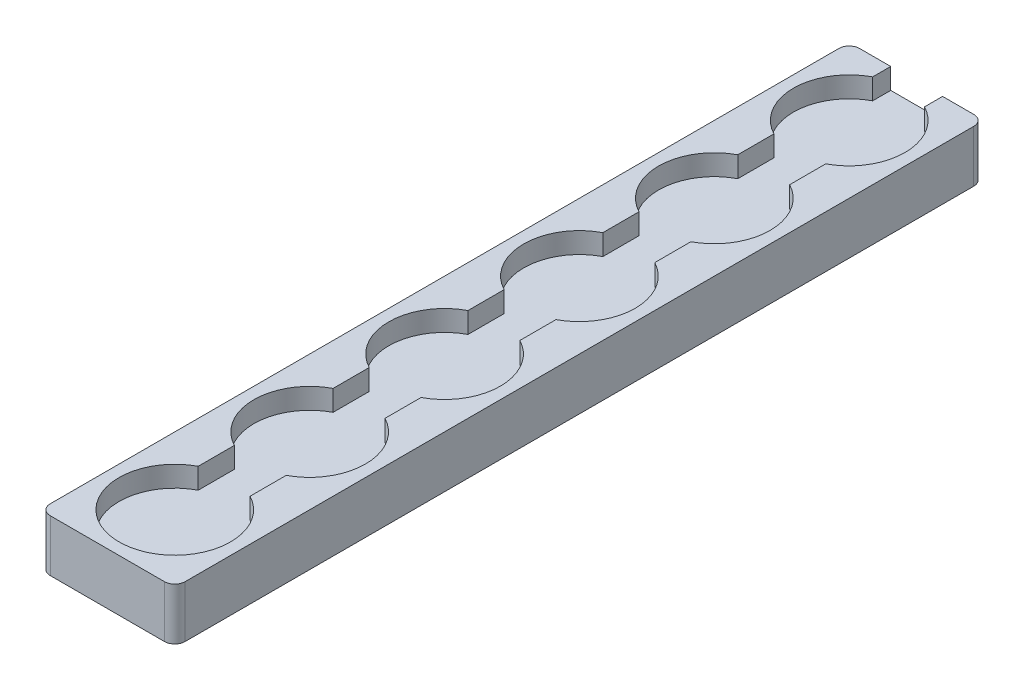
ISO-10303-21;
HEADER;
FILE_DESCRIPTION(('STEP AP214'),'2;1');
FILE_NAME('part.step','',(''),(''),'','','');
FILE_SCHEMA(('AUTOMOTIVE_DESIGN { 1 0 10303 214 1 1 1 1 }'));
ENDSEC;
DATA;
#1=APPLICATION_CONTEXT('core data for automotive mechanical design processes');
#2=APPLICATION_PROTOCOL_DEFINITION('international standard','automotive_design',2000,#1);
#3=PRODUCT_CONTEXT('',#1,'mechanical');
#4=PRODUCT('Part','Part','',(#3));
#5=PRODUCT_RELATED_PRODUCT_CATEGORY('part','',(#4));
#6=PRODUCT_DEFINITION_FORMATION('','',#4);
#7=PRODUCT_DEFINITION_CONTEXT('part definition',#1,'design');
#8=PRODUCT_DEFINITION('design','',#6,#7);
#9=PRODUCT_DEFINITION_SHAPE('','',#8);
#10=(LENGTH_UNIT() NAMED_UNIT(*) SI_UNIT(.MILLI.,.METRE.));
#11=(NAMED_UNIT(*) PLANE_ANGLE_UNIT() SI_UNIT($,.RADIAN.));
#12=(NAMED_UNIT(*) SI_UNIT($,.STERADIAN.) SOLID_ANGLE_UNIT());
#13=UNCERTAINTY_MEASURE_WITH_UNIT(LENGTH_MEASURE(1.E-05),#10,'distance_accuracy_value','');
#14=(GEOMETRIC_REPRESENTATION_CONTEXT(3) GLOBAL_UNCERTAINTY_ASSIGNED_CONTEXT((#13)) GLOBAL_UNIT_ASSIGNED_CONTEXT((#10,
#11,#12)) REPRESENTATION_CONTEXT('',''));
#15=CARTESIAN_POINT('',(0.,0.,0.));
#16=DIRECTION('',(0.,0.,1.));
#17=DIRECTION('',(1.,0.,0.));
#18=AXIS2_PLACEMENT_3D('',#15,#16,#17);
#19=CARTESIAN_POINT('',(0.,-4.,-130.));
#20=DIRECTION('',(0.,1.,0.));
#21=DIRECTION('',(0.,0.,1.));
#22=AXIS2_PLACEMENT_3D('',#19,#20,#21);
#23=CYLINDRICAL_SURFACE('',#22,10.75);
#24=CARTESIAN_POINT('',(0.,0.,-130.));
#25=DIRECTION('',(0.,1.,0.));
#26=DIRECTION('',(0.,0.,1.));
#27=AXIS2_PLACEMENT_3D('',#24,#25,#26);
#28=CIRCLE('',#27,10.75);
#29=CARTESIAN_POINT('',(-5.,0.,-139.516433155337));
#30=VERTEX_POINT('',#29);
#31=CARTESIAN_POINT('',(-5.,0.,-120.483566844663));
#32=VERTEX_POINT('',#31);
#33=EDGE_CURVE('E477',#30,#32,#28,.T.);
#34=ORIENTED_EDGE('',*,*,#33,.T.);
#35=DIRECTION('',(0.,1.,0.));
#36=VECTOR('',#35,1.);
#37=CARTESIAN_POINT('',(-5.,-4.,-120.483566844663));
#38=LINE('',#37,#36);
#39=CARTESIAN_POINT('',(-5.,-4.,-120.483566844663));
#40=VERTEX_POINT('',#39);
#41=EDGE_CURVE('E348',#32,#40,#38,.F.);
#42=ORIENTED_EDGE('',*,*,#41,.T.);
#43=CARTESIAN_POINT('',(0.,-4.,-130.));
#44=DIRECTION('',(0.,1.,0.));
#45=DIRECTION('',(0.,0.,1.));
#46=AXIS2_PLACEMENT_3D('',#43,#44,#45);
#47=CIRCLE('',#46,10.75);
#48=CARTESIAN_POINT('',(-5.,-4.,-139.516433155337));
#49=VERTEX_POINT('',#48);
#50=EDGE_CURVE('E473',#49,#40,#47,.T.);
#51=ORIENTED_EDGE('',*,*,#50,.F.);
#52=DIRECTION('',(0.,1.,0.));
#53=VECTOR('',#52,1.);
#54=CARTESIAN_POINT('',(-5.,-4.,-139.516433155337));
#55=LINE('',#54,#53);
#56=EDGE_CURVE('E432',#49,#30,#55,.T.);
#57=ORIENTED_EDGE('',*,*,#56,.T.);
#58=EDGE_LOOP('',(#34,#42,#51,#57));
#59=FACE_BOUND('',#58,.T.);
#60=ADVANCED_FACE('F48',(#59),#23,.F.);
#61=CARTESIAN_POINT('',(0.,-4.,-104.));
#62=DIRECTION('',(0.,1.,0.));
#63=DIRECTION('',(0.,0.,1.));
#64=AXIS2_PLACEMENT_3D('',#61,#62,#63);
#65=CYLINDRICAL_SURFACE('',#64,10.75);
#66=CARTESIAN_POINT('',(0.,0.,-104.));
#67=DIRECTION('',(0.,1.,0.));
#68=DIRECTION('',(0.,0.,1.));
#69=AXIS2_PLACEMENT_3D('',#66,#67,#68);
#70=CIRCLE('',#69,10.75);
#71=CARTESIAN_POINT('',(-5.,0.,-113.516433155337));
#72=VERTEX_POINT('',#71);
#73=CARTESIAN_POINT('',(-5.,0.,-94.4835668446629));
#74=VERTEX_POINT('',#73);
#75=EDGE_CURVE('E469',#72,#74,#70,.T.);
#76=ORIENTED_EDGE('',*,*,#75,.T.);
#77=DIRECTION('',(0.,1.,0.));
#78=VECTOR('',#77,1.);
#79=CARTESIAN_POINT('',(-5.,-4.,-94.4835668446629));
#80=LINE('',#79,#78);
#81=CARTESIAN_POINT('',(-5.,-4.,-94.4835668446629));
#82=VERTEX_POINT('',#81);
#83=EDGE_CURVE('E345',#74,#82,#80,.F.);
#84=ORIENTED_EDGE('',*,*,#83,.T.);
#85=CARTESIAN_POINT('',(0.,-4.,-104.));
#86=DIRECTION('',(0.,1.,0.));
#87=DIRECTION('',(0.,0.,1.));
#88=AXIS2_PLACEMENT_3D('',#85,#86,#87);
#89=CIRCLE('',#88,10.75);
#90=CARTESIAN_POINT('',(-5.,-4.,-113.516433155337));
#91=VERTEX_POINT('',#90);
#92=EDGE_CURVE('E465',#91,#82,#89,.T.);
#93=ORIENTED_EDGE('',*,*,#92,.F.);
#94=DIRECTION('',(0.,1.,0.));
#95=VECTOR('',#94,1.);
#96=CARTESIAN_POINT('',(-5.,-4.,-113.516433155337));
#97=LINE('',#96,#95);
#98=EDGE_CURVE('E408',#91,#72,#97,.T.);
#99=ORIENTED_EDGE('',*,*,#98,.T.);
#100=EDGE_LOOP('',(#76,#84,#93,#99));
#101=FACE_BOUND('',#100,.T.);
#102=ADVANCED_FACE('F614',(#101),#65,.F.);
#103=CARTESIAN_POINT('',(0.,-4.,-78.));
#104=DIRECTION('',(0.,1.,0.));
#105=DIRECTION('',(0.,0.,1.));
#106=AXIS2_PLACEMENT_3D('',#103,#104,#105);
#107=CYLINDRICAL_SURFACE('',#106,10.75);
#108=CARTESIAN_POINT('',(0.,0.,-78.));
#109=DIRECTION('',(0.,1.,0.));
#110=DIRECTION('',(0.,0.,1.));
#111=AXIS2_PLACEMENT_3D('',#108,#109,#110);
#112=CIRCLE('',#111,10.75);
#113=CARTESIAN_POINT('',(-5.,0.,-87.5164331553371));
#114=VERTEX_POINT('',#113);
#115=CARTESIAN_POINT('',(-5.,0.,-68.4835668446629));
#116=VERTEX_POINT('',#115);
#117=EDGE_CURVE('E461',#114,#116,#112,.T.);
#118=ORIENTED_EDGE('',*,*,#117,.T.);
#119=DIRECTION('',(0.,1.,0.));
#120=VECTOR('',#119,1.);
#121=CARTESIAN_POINT('',(-5.,-4.,-68.4835668446629));
#122=LINE('',#121,#120);
#123=CARTESIAN_POINT('',(-5.,-4.,-68.4835668446629));
#124=VERTEX_POINT('',#123);
#125=EDGE_CURVE('E342',#116,#124,#122,.F.);
#126=ORIENTED_EDGE('',*,*,#125,.T.);
#127=CARTESIAN_POINT('',(0.,-4.,-78.));
#128=DIRECTION('',(0.,1.,0.));
#129=DIRECTION('',(0.,0.,1.));
#130=AXIS2_PLACEMENT_3D('',#127,#128,#129);
#131=CIRCLE('',#130,10.75);
#132=CARTESIAN_POINT('',(-5.,-4.,-87.5164331553371));
#133=VERTEX_POINT('',#132);
#134=EDGE_CURVE('E457',#133,#124,#131,.T.);
#135=ORIENTED_EDGE('',*,*,#134,.F.);
#136=DIRECTION('',(0.,1.,0.));
#137=VECTOR('',#136,1.);
#138=CARTESIAN_POINT('',(-5.,-4.,-87.5164331553371));
#139=LINE('',#138,#137);
#140=EDGE_CURVE('E392',#133,#114,#139,.T.);
#141=ORIENTED_EDGE('',*,*,#140,.T.);
#142=EDGE_LOOP('',(#118,#126,#135,#141));
#143=FACE_BOUND('',#142,.T.);
#144=ADVANCED_FACE('F620',(#143),#107,.F.);
#145=CARTESIAN_POINT('',(0.,-4.,-52.));
#146=DIRECTION('',(0.,1.,0.));
#147=DIRECTION('',(0.,0.,1.));
#148=AXIS2_PLACEMENT_3D('',#145,#146,#147);
#149=CYLINDRICAL_SURFACE('',#148,10.75);
#150=CARTESIAN_POINT('',(0.,0.,-52.));
#151=DIRECTION('',(0.,1.,0.));
#152=DIRECTION('',(0.,0.,1.));
#153=AXIS2_PLACEMENT_3D('',#150,#151,#152);
#154=CIRCLE('',#153,10.75);
#155=CARTESIAN_POINT('',(-5.,0.,-61.5164331553371));
#156=VERTEX_POINT('',#155);
#157=CARTESIAN_POINT('',(-5.,0.,-42.4835668446629));
#158=VERTEX_POINT('',#157);
#159=EDGE_CURVE('E453',#156,#158,#154,.T.);
#160=ORIENTED_EDGE('',*,*,#159,.T.);
#161=DIRECTION('',(0.,1.,0.));
#162=VECTOR('',#161,1.);
#163=CARTESIAN_POINT('',(-5.,-4.,-42.4835668446629));
#164=LINE('',#163,#162);
#165=CARTESIAN_POINT('',(-5.,-4.,-42.4835668446629));
#166=VERTEX_POINT('',#165);
#167=EDGE_CURVE('E339',#158,#166,#164,.F.);
#168=ORIENTED_EDGE('',*,*,#167,.T.);
#169=CARTESIAN_POINT('',(0.,-4.,-52.));
#170=DIRECTION('',(0.,1.,0.));
#171=DIRECTION('',(0.,0.,1.));
#172=AXIS2_PLACEMENT_3D('',#169,#170,#171);
#173=CIRCLE('',#172,10.75);
#174=CARTESIAN_POINT('',(-5.,-4.,-61.5164331553371));
#175=VERTEX_POINT('',#174);
#176=EDGE_CURVE('E449',#175,#166,#173,.T.);
#177=ORIENTED_EDGE('',*,*,#176,.F.);
#178=DIRECTION('',(0.,1.,0.));
#179=VECTOR('',#178,1.);
#180=CARTESIAN_POINT('',(-5.,-4.,-61.5164331553371));
#181=LINE('',#180,#179);
#182=EDGE_CURVE('E376',#175,#156,#181,.T.);
#183=ORIENTED_EDGE('',*,*,#182,.T.);
#184=EDGE_LOOP('',(#160,#168,#177,#183));
#185=FACE_BOUND('',#184,.T.);
#186=ADVANCED_FACE('F688',(#185),#149,.F.);
#187=CARTESIAN_POINT('',(0.,-4.,-26.));
#188=DIRECTION('',(0.,1.,0.));
#189=DIRECTION('',(0.,0.,1.));
#190=AXIS2_PLACEMENT_3D('',#187,#188,#189);
#191=CYLINDRICAL_SURFACE('',#190,10.75);
#192=CARTESIAN_POINT('',(0.,0.,-26.));
#193=DIRECTION('',(0.,1.,0.));
#194=DIRECTION('',(0.,0.,1.));
#195=AXIS2_PLACEMENT_3D('',#192,#193,#194);
#196=CIRCLE('',#195,10.75);
#197=CARTESIAN_POINT('',(-5.,0.,-35.5164331553371));
#198=VERTEX_POINT('',#197);
#199=CARTESIAN_POINT('',(-5.,0.,-16.4835668446629));
#200=VERTEX_POINT('',#199);
#201=EDGE_CURVE('E445',#198,#200,#196,.T.);
#202=ORIENTED_EDGE('',*,*,#201,.T.);
#203=DIRECTION('',(0.,1.,0.));
#204=VECTOR('',#203,1.);
#205=CARTESIAN_POINT('',(-5.,-4.,-16.4835668446629));
#206=LINE('',#205,#204);
#207=CARTESIAN_POINT('',(-5.,-4.,-16.4835668446628));
#208=VERTEX_POINT('',#207);
#209=EDGE_CURVE('E336',#200,#208,#206,.F.);
#210=ORIENTED_EDGE('',*,*,#209,.T.);
#211=CARTESIAN_POINT('',(0.,-4.,-26.));
#212=DIRECTION('',(0.,1.,0.));
#213=DIRECTION('',(0.,0.,1.));
#214=AXIS2_PLACEMENT_3D('',#211,#212,#213);
#215=CIRCLE('',#214,10.75);
#216=CARTESIAN_POINT('',(-5.,-4.,-35.5164331553371));
#217=VERTEX_POINT('',#216);
#218=EDGE_CURVE('E440',#217,#208,#215,.T.);
#219=ORIENTED_EDGE('',*,*,#218,.F.);
#220=DIRECTION('',(0.,1.,0.));
#221=VECTOR('',#220,1.);
#222=CARTESIAN_POINT('',(-5.,-4.,-35.5164331553371));
#223=LINE('',#222,#221);
#224=EDGE_CURVE('E358',#217,#198,#223,.T.);
#225=ORIENTED_EDGE('',*,*,#224,.T.);
#226=EDGE_LOOP('',(#202,#210,#219,#225));
#227=FACE_BOUND('',#226,.T.);
#228=ADVANCED_FACE('F679',(#227),#191,.F.);
#229=CARTESIAN_POINT('',(0.,0.,0.));
#230=DIRECTION('',(0.,1.,0.));
#231=DIRECTION('',(0.,0.,1.));
#232=AXIS2_PLACEMENT_3D('',#229,#230,#231);
#233=PLANE('',#232);
#234=DIRECTION('',(0.,0.,-1.));
#235=VECTOR('',#234,1.);
#236=CARTESIAN_POINT('',(13.,0.,-13.));
#237=LINE('',#236,#235);
#238=CARTESIAN_POINT('',(13.,0.,11.));
#239=VERTEX_POINT('',#238);
#240=CARTESIAN_POINT('',(13.,0.,-141.));
#241=VERTEX_POINT('',#240);
#242=EDGE_CURVE('E510',#239,#241,#237,.T.);
#243=ORIENTED_EDGE('',*,*,#242,.T.);
#244=CARTESIAN_POINT('',(11.,0.,-141.));
#245=DIRECTION('',(0.,1.,0.));
#246=DIRECTION('',(0.,0.,1.));
#247=AXIS2_PLACEMENT_3D('',#244,#245,#246);
#248=CIRCLE('',#247,2.);
#249=CARTESIAN_POINT('',(11.,0.,-143.));
#250=VERTEX_POINT('',#249);
#251=EDGE_CURVE('E533',#241,#250,#248,.T.);
#252=ORIENTED_EDGE('',*,*,#251,.T.);
#253=DIRECTION('',(-1.,0.,0.));
#254=VECTOR('',#253,1.);
#255=CARTESIAN_POINT('',(-13.,0.,-143.));
#256=LINE('',#255,#254);
#257=CARTESIAN_POINT('',(5.,0.,-143.));
#258=VERTEX_POINT('',#257);
#259=EDGE_CURVE('E484',#250,#258,#256,.T.);
#260=ORIENTED_EDGE('',*,*,#259,.T.);
#261=DIRECTION('',(0.,0.,1.));
#262=VECTOR('',#261,1.);
#263=CARTESIAN_POINT('',(5.,0.,-143.));
#264=LINE('',#263,#262);
#265=CARTESIAN_POINT('',(5.,0.,-139.516433155337));
#266=VERTEX_POINT('',#265);
#267=EDGE_CURVE('E351',#258,#266,#264,.T.);
#268=ORIENTED_EDGE('',*,*,#267,.T.);
#269=CARTESIAN_POINT('',(4.99999999999999,0.,-120.483566844663));
#270=VERTEX_POINT('',#269);
#271=EDGE_CURVE('E369',#270,#266,#28,.T.);
#272=ORIENTED_EDGE('',*,*,#271,.F.);
#273=DIRECTION('',(0.,0.,1.));
#274=VECTOR('',#273,1.);
#275=CARTESIAN_POINT('',(5.,0.,-117.));
#276=LINE('',#275,#274);
#277=CARTESIAN_POINT('',(5.,0.,-113.516433155337));
#278=VERTEX_POINT('',#277);
#279=EDGE_CURVE('E409',#270,#278,#276,.T.);
#280=ORIENTED_EDGE('',*,*,#279,.T.);
#281=CARTESIAN_POINT('',(4.99999999999999,0.,-94.4835668446629));
#282=VERTEX_POINT('',#281);
#283=EDGE_CURVE('E472',#282,#278,#70,.T.);
#284=ORIENTED_EDGE('',*,*,#283,.F.);
#285=DIRECTION('',(0.,0.,1.));
#286=VECTOR('',#285,1.);
#287=CARTESIAN_POINT('',(5.,0.,-91.));
#288=LINE('',#287,#286);
#289=CARTESIAN_POINT('',(5.,0.,-87.5164331553371));
#290=VERTEX_POINT('',#289);
#291=EDGE_CURVE('E393',#282,#290,#288,.T.);
#292=ORIENTED_EDGE('',*,*,#291,.T.);
#293=CARTESIAN_POINT('',(4.99999999999999,0.,-68.4835668446629));
#294=VERTEX_POINT('',#293);
#295=EDGE_CURVE('E464',#294,#290,#112,.T.);
#296=ORIENTED_EDGE('',*,*,#295,.F.);
#297=DIRECTION('',(0.,0.,1.));
#298=VECTOR('',#297,1.);
#299=CARTESIAN_POINT('',(5.,0.,-65.));
#300=LINE('',#299,#298);
#301=CARTESIAN_POINT('',(5.,0.,-61.5164331553371));
#302=VERTEX_POINT('',#301);
#303=EDGE_CURVE('E377',#294,#302,#300,.T.);
#304=ORIENTED_EDGE('',*,*,#303,.T.);
#305=CARTESIAN_POINT('',(4.99999999999999,0.,-42.4835668446629));
#306=VERTEX_POINT('',#305);
#307=EDGE_CURVE('E456',#306,#302,#154,.T.);
#308=ORIENTED_EDGE('',*,*,#307,.F.);
#309=DIRECTION('',(0.,0.,1.));
#310=VECTOR('',#309,1.);
#311=CARTESIAN_POINT('',(5.,0.,-39.));
#312=LINE('',#311,#310);
#313=CARTESIAN_POINT('',(5.,0.,-35.5164331553371));
#314=VERTEX_POINT('',#313);
#315=EDGE_CURVE('E359',#306,#314,#312,.T.);
#316=ORIENTED_EDGE('',*,*,#315,.T.);
#317=CARTESIAN_POINT('',(4.99999999999999,0.,-16.4835668446628));
#318=VERTEX_POINT('',#317);
#319=EDGE_CURVE('E448',#318,#314,#196,.T.);
#320=ORIENTED_EDGE('',*,*,#319,.F.);
#321=DIRECTION('',(0.,0.,1.));
#322=VECTOR('',#321,1.);
#323=CARTESIAN_POINT('',(5.,0.,-13.));
#324=LINE('',#323,#322);
#325=CARTESIAN_POINT('',(5.,0.,-9.51643315533714));
#326=VERTEX_POINT('',#325);
#327=EDGE_CURVE('E483',#318,#326,#324,.T.);
#328=ORIENTED_EDGE('',*,*,#327,.T.);
#329=CARTESIAN_POINT('',(0.,0.,0.));
#330=DIRECTION('',(0.,1.,0.));
#331=DIRECTION('',(0.,0.,1.));
#332=AXIS2_PLACEMENT_3D('',#329,#330,#331);
#333=CIRCLE('',#332,10.75);
#334=CARTESIAN_POINT('',(-5.,0.,-9.51643315533714));
#335=VERTEX_POINT('',#334);
#336=EDGE_CURVE('E499',#335,#326,#333,.T.);
#337=ORIENTED_EDGE('',*,*,#336,.F.);
#338=DIRECTION('',(0.,0.,1.));
#339=VECTOR('',#338,1.);
#340=CARTESIAN_POINT('',(-5.,0.,-13.));
#341=LINE('',#340,#339);
#342=EDGE_CURVE('E489',#200,#335,#341,.T.);
#343=ORIENTED_EDGE('',*,*,#342,.F.);
#344=ORIENTED_EDGE('',*,*,#201,.F.);
#345=DIRECTION('',(0.,0.,1.));
#346=VECTOR('',#345,1.);
#347=CARTESIAN_POINT('',(-5.,0.,-39.));
#348=LINE('',#347,#346);
#349=EDGE_CURVE('E356',#158,#198,#348,.T.);
#350=ORIENTED_EDGE('',*,*,#349,.F.);
#351=ORIENTED_EDGE('',*,*,#159,.F.);
#352=DIRECTION('',(0.,0.,1.));
#353=VECTOR('',#352,1.);
#354=CARTESIAN_POINT('',(-5.,0.,-65.));
#355=LINE('',#354,#353);
#356=EDGE_CURVE('E374',#116,#156,#355,.T.);
#357=ORIENTED_EDGE('',*,*,#356,.F.);
#358=ORIENTED_EDGE('',*,*,#117,.F.);
#359=DIRECTION('',(0.,0.,1.));
#360=VECTOR('',#359,1.);
#361=CARTESIAN_POINT('',(-5.,0.,-91.));
#362=LINE('',#361,#360);
#363=EDGE_CURVE('E390',#74,#114,#362,.T.);
#364=ORIENTED_EDGE('',*,*,#363,.F.);
#365=ORIENTED_EDGE('',*,*,#75,.F.);
#366=DIRECTION('',(0.,0.,1.));
#367=VECTOR('',#366,1.);
#368=CARTESIAN_POINT('',(-5.,0.,-117.));
#369=LINE('',#368,#367);
#370=EDGE_CURVE('E406',#32,#72,#369,.T.);
#371=ORIENTED_EDGE('',*,*,#370,.F.);
#372=ORIENTED_EDGE('',*,*,#33,.F.);
#373=DIRECTION('',(0.,0.,1.));
#374=VECTOR('',#373,1.);
#375=CARTESIAN_POINT('',(-5.,0.,-143.));
#376=LINE('',#375,#374);
#377=CARTESIAN_POINT('',(-5.,0.,-143.));
#378=VERTEX_POINT('',#377);
#379=EDGE_CURVE('E422',#378,#30,#376,.T.);
#380=ORIENTED_EDGE('',*,*,#379,.F.);
#381=CARTESIAN_POINT('',(-11.,0.,-143.));
#382=VERTEX_POINT('',#381);
#383=EDGE_CURVE('E443',#378,#382,#256,.T.);
#384=ORIENTED_EDGE('',*,*,#383,.T.);
#385=CARTESIAN_POINT('',(-11.,0.,-141.));
#386=DIRECTION('',(0.,1.,0.));
#387=DIRECTION('',(0.,0.,1.));
#388=AXIS2_PLACEMENT_3D('',#385,#386,#387);
#389=CIRCLE('',#388,2.);
#390=CARTESIAN_POINT('',(-13.,0.,-141.));
#391=VERTEX_POINT('',#390);
#392=EDGE_CURVE('E527',#382,#391,#389,.T.);
#393=ORIENTED_EDGE('',*,*,#392,.T.);
#394=DIRECTION('',(0.,0.,1.));
#395=VECTOR('',#394,1.);
#396=CARTESIAN_POINT('',(-13.,0.,-13.));
#397=LINE('',#396,#395);
#398=CARTESIAN_POINT('',(-13.,0.,11.));
#399=VERTEX_POINT('',#398);
#400=EDGE_CURVE('E503',#391,#399,#397,.T.);
#401=ORIENTED_EDGE('',*,*,#400,.T.);
#402=CARTESIAN_POINT('',(-11.,0.,11.));
#403=DIRECTION('',(0.,1.,0.));
#404=DIRECTION('',(0.,0.,1.));
#405=AXIS2_PLACEMENT_3D('',#402,#403,#404);
#406=CIRCLE('',#405,2.);
#407=CARTESIAN_POINT('',(-11.,0.,13.));
#408=VERTEX_POINT('',#407);
#409=EDGE_CURVE('E529',#399,#408,#406,.T.);
#410=ORIENTED_EDGE('',*,*,#409,.T.);
#411=DIRECTION('',(1.,0.,0.));
#412=VECTOR('',#411,1.);
#413=CARTESIAN_POINT('',(-13.,0.,13.));
#414=LINE('',#413,#412);
#415=CARTESIAN_POINT('',(11.,0.,13.));
#416=VERTEX_POINT('',#415);
#417=EDGE_CURVE('E518',#408,#416,#414,.T.);
#418=ORIENTED_EDGE('',*,*,#417,.T.);
#419=CARTESIAN_POINT('',(11.,0.,11.));
#420=DIRECTION('',(0.,1.,0.));
#421=DIRECTION('',(0.,0.,1.));
#422=AXIS2_PLACEMENT_3D('',#419,#420,#421);
#423=CIRCLE('',#422,2.);
#424=EDGE_CURVE('E531',#416,#239,#423,.T.);
#425=ORIENTED_EDGE('',*,*,#424,.T.);
#426=EDGE_LOOP('',(#243,#252,#260,#268,#272,#280,#284,#292,#296,#304,#308,#316,#320,#328,#337,
#343,#344,#350,#351,#357,#358,#364,#365,#371,#372,#380,#384,#393,#401,#410,#418,#425));
#427=FACE_BOUND('',#426,.T.);
#428=ADVANCED_FACE('F571',(#427),#233,.T.);
#429=CARTESIAN_POINT('',(-13.,-10.,-143.));
#430=DIRECTION('',(0.,0.,-1.));
#431=DIRECTION('',(-1.,0.,0.));
#432=AXIS2_PLACEMENT_3D('',#429,#430,#431);
#433=PLANE('',#432);
#434=DIRECTION('',(0.,-1.,0.));
#435=VECTOR('',#434,1.);
#436=CARTESIAN_POINT('',(4.,-5.5,-143.));
#437=LINE('',#436,#435);
#438=CARTESIAN_POINT('',(4.,-5.5,-143.));
#439=VERTEX_POINT('',#438);
#440=CARTESIAN_POINT('',(4.,-8.5,-143.));
#441=VERTEX_POINT('',#440);
#442=EDGE_CURVE('E63',#439,#441,#437,.T.);
#443=ORIENTED_EDGE('',*,*,#442,.F.);
#444=DIRECTION('',(1.,0.,0.));
#445=VECTOR('',#444,1.);
#446=CARTESIAN_POINT('',(4.,-5.5,-143.));
#447=LINE('',#446,#445);
#448=CARTESIAN_POINT('',(-4.,-5.5,-143.));
#449=VERTEX_POINT('',#448);
#450=EDGE_CURVE('E303',#449,#439,#447,.T.);
#451=ORIENTED_EDGE('',*,*,#450,.F.);
#452=DIRECTION('',(0.,1.,0.));
#453=VECTOR('',#452,1.);
#454=CARTESIAN_POINT('',(-4.,-5.5,-143.));
#455=LINE('',#454,#453);
#456=CARTESIAN_POINT('',(-4.,-8.5,-143.));
#457=VERTEX_POINT('',#456);
#458=EDGE_CURVE('E306',#457,#449,#455,.T.);
#459=ORIENTED_EDGE('',*,*,#458,.F.);
#460=DIRECTION('',(-1.,0.,0.));
#461=VECTOR('',#460,1.);
#462=CARTESIAN_POINT('',(4.,-8.5,-143.));
#463=LINE('',#462,#461);
#464=EDGE_CURVE('E312',#441,#457,#463,.T.);
#465=ORIENTED_EDGE('',*,*,#464,.F.);
#466=EDGE_LOOP('',(#443,#451,#459,#465));
#467=FACE_BOUND('',#466,.T.);
#468=ORIENTED_EDGE('',*,*,#259,.F.);
#469=DIRECTION('',(0.,1.,0.));
#470=VECTOR('',#469,1.);
#471=CARTESIAN_POINT('',(11.,-10.,-143.));
#472=LINE('',#471,#470);
#473=CARTESIAN_POINT('',(11.,-10.,-143.));
#474=VERTEX_POINT('',#473);
#475=EDGE_CURVE('E538',#250,#474,#472,.F.);
#476=ORIENTED_EDGE('',*,*,#475,.T.);
#477=DIRECTION('',(-1.,0.,0.));
#478=VECTOR('',#477,1.);
#479=CARTESIAN_POINT('',(-13.,-10.,-143.));
#480=LINE('',#479,#478);
#481=CARTESIAN_POINT('',(-11.,-10.,-143.));
#482=VERTEX_POINT('',#481);
#483=EDGE_CURVE('E480',#474,#482,#480,.T.);
#484=ORIENTED_EDGE('',*,*,#483,.T.);
#485=DIRECTION('',(0.,1.,0.));
#486=VECTOR('',#485,1.);
#487=CARTESIAN_POINT('',(-11.,-10.,-143.));
#488=LINE('',#487,#486);
#489=EDGE_CURVE('E535',#482,#382,#488,.T.);
#490=ORIENTED_EDGE('',*,*,#489,.T.);
#491=ORIENTED_EDGE('',*,*,#383,.F.);
#492=DIRECTION('',(0.,1.,0.));
#493=VECTOR('',#492,1.);
#494=CARTESIAN_POINT('',(-5.,-4.,-143.));
#495=LINE('',#494,#493);
#496=CARTESIAN_POINT('',(-5.,-4.,-143.));
#497=VERTEX_POINT('',#496);
#498=EDGE_CURVE('E427',#497,#378,#495,.T.);
#499=ORIENTED_EDGE('',*,*,#498,.F.);
#500=DIRECTION('',(1.,0.,0.));
#501=VECTOR('',#500,1.);
#502=CARTESIAN_POINT('',(-5.,-4.,-143.));
#503=LINE('',#502,#501);
#504=CARTESIAN_POINT('',(5.,-4.,-143.));
#505=VERTEX_POINT('',#504);
#506=EDGE_CURVE('E418',#497,#505,#503,.T.);
#507=ORIENTED_EDGE('',*,*,#506,.T.);
#508=DIRECTION('',(0.,1.,0.));
#509=VECTOR('',#508,1.);
#510=CARTESIAN_POINT('',(5.,-4.,-143.));
#511=LINE('',#510,#509);
#512=EDGE_CURVE('E412',#505,#258,#511,.T.);
#513=ORIENTED_EDGE('',*,*,#512,.T.);
#514=EDGE_LOOP('',(#468,#476,#484,#490,#491,#499,#507,#513));
#515=FACE_BOUND('',#514,.T.);
#516=ADVANCED_FACE('F567',(#467,#515),#433,.T.);
#517=CARTESIAN_POINT('',(-13.,-10.,-13.));
#518=DIRECTION('',(-1.,0.,0.));
#519=DIRECTION('',(0.,0.,1.));
#520=AXIS2_PLACEMENT_3D('',#517,#518,#519);
#521=PLANE('',#520);
#522=DIRECTION('',(0.,0.,1.));
#523=VECTOR('',#522,1.);
#524=CARTESIAN_POINT('',(-13.,-10.,-13.));
#525=LINE('',#524,#523);
#526=CARTESIAN_POINT('',(-13.,-10.,-141.));
#527=VERTEX_POINT('',#526);
#528=CARTESIAN_POINT('',(-13.,-10.,11.));
#529=VERTEX_POINT('',#528);
#530=EDGE_CURVE('E506',#527,#529,#525,.T.);
#531=ORIENTED_EDGE('',*,*,#530,.T.);
#532=DIRECTION('',(0.,1.,0.));
#533=VECTOR('',#532,1.);
#534=CARTESIAN_POINT('',(-13.,-10.,11.));
#535=LINE('',#534,#533);
#536=EDGE_CURVE('E13',#529,#399,#535,.T.);
#537=ORIENTED_EDGE('',*,*,#536,.T.);
#538=ORIENTED_EDGE('',*,*,#400,.F.);
#539=DIRECTION('',(0.,1.,0.));
#540=VECTOR('',#539,1.);
#541=CARTESIAN_POINT('',(-13.,-10.,-141.));
#542=LINE('',#541,#540);
#543=EDGE_CURVE('E56',#391,#527,#542,.F.);
#544=ORIENTED_EDGE('',*,*,#543,.T.);
#545=EDGE_LOOP('',(#531,#537,#538,#544));
#546=FACE_BOUND('',#545,.T.);
#547=ADVANCED_FACE('F555',(#546),#521,.T.);
#548=CARTESIAN_POINT('',(13.,-10.,-13.));
#549=DIRECTION('',(1.,0.,0.));
#550=DIRECTION('',(0.,0.,-1.));
#551=AXIS2_PLACEMENT_3D('',#548,#549,#550);
#552=PLANE('',#551);
#553=DIRECTION('',(0.,0.,-1.));
#554=VECTOR('',#553,1.);
#555=CARTESIAN_POINT('',(13.,-10.,-13.));
#556=LINE('',#555,#554);
#557=CARTESIAN_POINT('',(13.,-10.,11.));
#558=VERTEX_POINT('',#557);
#559=CARTESIAN_POINT('',(13.,-10.,-141.));
#560=VERTEX_POINT('',#559);
#561=EDGE_CURVE('E512',#558,#560,#556,.T.);
#562=ORIENTED_EDGE('',*,*,#561,.T.);
#563=DIRECTION('',(0.,1.,0.));
#564=VECTOR('',#563,1.);
#565=CARTESIAN_POINT('',(13.,-10.,-141.));
#566=LINE('',#565,#564);
#567=EDGE_CURVE('E524',#560,#241,#566,.T.);
#568=ORIENTED_EDGE('',*,*,#567,.T.);
#569=ORIENTED_EDGE('',*,*,#242,.F.);
#570=DIRECTION('',(0.,1.,0.));
#571=VECTOR('',#570,1.);
#572=CARTESIAN_POINT('',(13.,-10.,11.));
#573=LINE('',#572,#571);
#574=EDGE_CURVE('E515',#239,#558,#573,.F.);
#575=ORIENTED_EDGE('',*,*,#574,.T.);
#576=EDGE_LOOP('',(#562,#568,#569,#575));
#577=FACE_BOUND('',#576,.T.);
#578=ADVANCED_FACE('F596',(#577),#552,.T.);
#579=CARTESIAN_POINT('',(-13.,-10.,13.));
#580=DIRECTION('',(0.,0.,1.));
#581=DIRECTION('',(1.,0.,0.));
#582=AXIS2_PLACEMENT_3D('',#579,#580,#581);
#583=PLANE('',#582);
#584=DIRECTION('',(1.,0.,0.));
#585=VECTOR('',#584,1.);
#586=CARTESIAN_POINT('',(-13.,-10.,13.));
#587=LINE('',#586,#585);
#588=CARTESIAN_POINT('',(-11.,-10.,13.));
#589=VERTEX_POINT('',#588);
#590=CARTESIAN_POINT('',(11.,-10.,13.));
#591=VERTEX_POINT('',#590);
#592=EDGE_CURVE('E509',#589,#591,#587,.T.);
#593=ORIENTED_EDGE('',*,*,#592,.T.);
#594=DIRECTION('',(0.,1.,0.));
#595=VECTOR('',#594,1.);
#596=CARTESIAN_POINT('',(11.,-10.,13.));
#597=LINE('',#596,#595);
#598=EDGE_CURVE('E549',#591,#416,#597,.T.);
#599=ORIENTED_EDGE('',*,*,#598,.T.);
#600=ORIENTED_EDGE('',*,*,#417,.F.);
#601=DIRECTION('',(0.,1.,0.));
#602=VECTOR('',#601,1.);
#603=CARTESIAN_POINT('',(-11.,-10.,13.));
#604=LINE('',#603,#602);
#605=EDGE_CURVE('E547',#408,#589,#604,.F.);
#606=ORIENTED_EDGE('',*,*,#605,.T.);
#607=EDGE_LOOP('',(#593,#599,#600,#606));
#608=FACE_BOUND('',#607,.T.);
#609=ADVANCED_FACE('F603',(#608),#583,.T.);
#610=CARTESIAN_POINT('',(0.,-10.,0.));
#611=DIRECTION('',(0.,1.,0.));
#612=DIRECTION('',(0.,0.,1.));
#613=AXIS2_PLACEMENT_3D('',#610,#611,#612);
#614=PLANE('',#613);
#615=ORIENTED_EDGE('',*,*,#483,.F.);
#616=CARTESIAN_POINT('',(11.,-10.,-141.));
#617=DIRECTION('',(0.,1.,0.));
#618=DIRECTION('',(0.,0.,1.));
#619=AXIS2_PLACEMENT_3D('',#616,#617,#618);
#620=CIRCLE('',#619,2.);
#621=EDGE_CURVE('E545',#474,#560,#620,.F.);
#622=ORIENTED_EDGE('',*,*,#621,.T.);
#623=ORIENTED_EDGE('',*,*,#561,.F.);
#624=CARTESIAN_POINT('',(11.,-10.,11.));
#625=DIRECTION('',(0.,1.,0.));
#626=DIRECTION('',(0.,0.,1.));
#627=AXIS2_PLACEMENT_3D('',#624,#625,#626);
#628=CIRCLE('',#627,2.);
#629=EDGE_CURVE('E71',#558,#591,#628,.F.);
#630=ORIENTED_EDGE('',*,*,#629,.T.);
#631=ORIENTED_EDGE('',*,*,#592,.F.);
#632=CARTESIAN_POINT('',(-11.,-10.,11.));
#633=DIRECTION('',(0.,1.,0.));
#634=DIRECTION('',(0.,0.,1.));
#635=AXIS2_PLACEMENT_3D('',#632,#633,#634);
#636=CIRCLE('',#635,2.);
#637=EDGE_CURVE('E542',#589,#529,#636,.F.);
#638=ORIENTED_EDGE('',*,*,#637,.T.);
#639=ORIENTED_EDGE('',*,*,#530,.F.);
#640=CARTESIAN_POINT('',(-11.,-10.,-141.));
#641=DIRECTION('',(0.,1.,0.));
#642=DIRECTION('',(0.,0.,1.));
#643=AXIS2_PLACEMENT_3D('',#640,#641,#642);
#644=CIRCLE('',#643,2.);
#645=EDGE_CURVE('E540',#527,#482,#644,.F.);
#646=ORIENTED_EDGE('',*,*,#645,.T.);
#647=EDGE_LOOP('',(#615,#622,#623,#630,#631,#638,#639,#646));
#648=FACE_BOUND('',#647,.T.);
#649=ADVANCED_FACE('F560',(#648),#614,.F.);
#650=CARTESIAN_POINT('',(0.,-4.,0.));
#651=DIRECTION('',(0.,1.,0.));
#652=DIRECTION('',(0.,0.,1.));
#653=AXIS2_PLACEMENT_3D('',#650,#651,#652);
#654=CYLINDRICAL_SURFACE('',#653,10.75);
#655=ORIENTED_EDGE('',*,*,#336,.T.);
#656=DIRECTION('',(0.,1.,0.));
#657=VECTOR('',#656,1.);
#658=CARTESIAN_POINT('',(5.,-4.,-9.51643315533714));
#659=LINE('',#658,#657);
#660=CARTESIAN_POINT('',(5.,-4.,-9.51643315533714));
#661=VERTEX_POINT('',#660);
#662=EDGE_CURVE('E497',#661,#326,#659,.T.);
#663=ORIENTED_EDGE('',*,*,#662,.F.);
#664=CARTESIAN_POINT('',(0.,-4.,0.));
#665=DIRECTION('',(0.,1.,0.));
#666=DIRECTION('',(0.,0.,1.));
#667=AXIS2_PLACEMENT_3D('',#664,#665,#666);
#668=CIRCLE('',#667,10.75);
#669=CARTESIAN_POINT('',(-5.,-4.,-9.51643315533714));
#670=VERTEX_POINT('',#669);
#671=EDGE_CURVE('E500',#670,#661,#668,.T.);
#672=ORIENTED_EDGE('',*,*,#671,.F.);
#673=DIRECTION('',(0.,1.,0.));
#674=VECTOR('',#673,1.);
#675=CARTESIAN_POINT('',(-5.,-4.,-9.51643315533714));
#676=LINE('',#675,#674);
#677=EDGE_CURVE('E491',#670,#335,#676,.T.);
#678=ORIENTED_EDGE('',*,*,#677,.T.);
#679=EDGE_LOOP('',(#655,#663,#672,#678));
#680=FACE_BOUND('',#679,.T.);
#681=ADVANCED_FACE('F673',(#680),#654,.F.);
#682=CARTESIAN_POINT('',(0.,-4.,0.));
#683=DIRECTION('',(0.,1.,0.));
#684=DIRECTION('',(0.,0.,1.));
#685=AXIS2_PLACEMENT_3D('',#682,#683,#684);
#686=PLANE('',#685);
#687=ORIENTED_EDGE('',*,*,#671,.T.);
#688=DIRECTION('',(0.,0.,1.));
#689=VECTOR('',#688,1.);
#690=CARTESIAN_POINT('',(5.,-4.,-13.));
#691=LINE('',#690,#689);
#692=CARTESIAN_POINT('',(4.99999999999999,-4.,-16.4835668446629));
#693=VERTEX_POINT('',#692);
#694=EDGE_CURVE('E486',#693,#661,#691,.T.);
#695=ORIENTED_EDGE('',*,*,#694,.F.);
#696=CARTESIAN_POINT('',(5.,-4.,-35.5164331553371));
#697=VERTEX_POINT('',#696);
#698=EDGE_CURVE('E444',#693,#697,#215,.T.);
#699=ORIENTED_EDGE('',*,*,#698,.T.);
#700=DIRECTION('',(0.,0.,1.));
#701=VECTOR('',#700,1.);
#702=CARTESIAN_POINT('',(5.,-4.,-39.));
#703=LINE('',#702,#701);
#704=CARTESIAN_POINT('',(4.99999999999999,-4.,-42.4835668446629));
#705=VERTEX_POINT('',#704);
#706=EDGE_CURVE('E352',#705,#697,#703,.T.);
#707=ORIENTED_EDGE('',*,*,#706,.F.);
#708=CARTESIAN_POINT('',(5.,-4.,-61.5164331553371));
#709=VERTEX_POINT('',#708);
#710=EDGE_CURVE('E452',#705,#709,#173,.T.);
#711=ORIENTED_EDGE('',*,*,#710,.T.);
#712=DIRECTION('',(0.,0.,1.));
#713=VECTOR('',#712,1.);
#714=CARTESIAN_POINT('',(5.,-4.,-65.));
#715=LINE('',#714,#713);
#716=CARTESIAN_POINT('',(4.99999999999999,-4.,-68.4835668446629));
#717=VERTEX_POINT('',#716);
#718=EDGE_CURVE('E370',#717,#709,#715,.T.);
#719=ORIENTED_EDGE('',*,*,#718,.F.);
#720=CARTESIAN_POINT('',(5.,-4.,-87.5164331553371));
#721=VERTEX_POINT('',#720);
#722=EDGE_CURVE('E460',#717,#721,#131,.T.);
#723=ORIENTED_EDGE('',*,*,#722,.T.);
#724=DIRECTION('',(0.,0.,1.));
#725=VECTOR('',#724,1.);
#726=CARTESIAN_POINT('',(5.,-4.,-91.));
#727=LINE('',#726,#725);
#728=CARTESIAN_POINT('',(4.99999999999999,-4.,-94.4835668446629));
#729=VERTEX_POINT('',#728);
#730=EDGE_CURVE('E386',#729,#721,#727,.T.);
#731=ORIENTED_EDGE('',*,*,#730,.F.);
#732=CARTESIAN_POINT('',(5.,-4.,-113.516433155337));
#733=VERTEX_POINT('',#732);
#734=EDGE_CURVE('E468',#729,#733,#89,.T.);
#735=ORIENTED_EDGE('',*,*,#734,.T.);
#736=DIRECTION('',(0.,0.,1.));
#737=VECTOR('',#736,1.);
#738=CARTESIAN_POINT('',(5.,-4.,-117.));
#739=LINE('',#738,#737);
#740=CARTESIAN_POINT('',(4.99999999999999,-4.,-120.483566844663));
#741=VERTEX_POINT('',#740);
#742=EDGE_CURVE('E402',#741,#733,#739,.T.);
#743=ORIENTED_EDGE('',*,*,#742,.F.);
#744=CARTESIAN_POINT('',(5.,-4.,-139.516433155337));
#745=VERTEX_POINT('',#744);
#746=EDGE_CURVE('E476',#741,#745,#47,.T.);
#747=ORIENTED_EDGE('',*,*,#746,.T.);
#748=DIRECTION('',(0.,0.,1.));
#749=VECTOR('',#748,1.);
#750=CARTESIAN_POINT('',(5.,-4.,-143.));
#751=LINE('',#750,#749);
#752=EDGE_CURVE('E421',#505,#745,#751,.T.);
#753=ORIENTED_EDGE('',*,*,#752,.F.);
#754=ORIENTED_EDGE('',*,*,#506,.F.);
#755=DIRECTION('',(0.,0.,1.));
#756=VECTOR('',#755,1.);
#757=CARTESIAN_POINT('',(-5.,-4.,-143.));
#758=LINE('',#757,#756);
#759=EDGE_CURVE('E425',#497,#49,#758,.T.);
#760=ORIENTED_EDGE('',*,*,#759,.T.);
#761=ORIENTED_EDGE('',*,*,#50,.T.);
#762=DIRECTION('',(0.,0.,1.));
#763=VECTOR('',#762,1.);
#764=CARTESIAN_POINT('',(-5.,-4.,-117.));
#765=LINE('',#764,#763);
#766=EDGE_CURVE('E405',#40,#91,#765,.T.);
#767=ORIENTED_EDGE('',*,*,#766,.T.);
#768=ORIENTED_EDGE('',*,*,#92,.T.);
#769=DIRECTION('',(0.,0.,1.));
#770=VECTOR('',#769,1.);
#771=CARTESIAN_POINT('',(-5.,-4.,-91.));
#772=LINE('',#771,#770);
#773=EDGE_CURVE('E389',#82,#133,#772,.T.);
#774=ORIENTED_EDGE('',*,*,#773,.T.);
#775=ORIENTED_EDGE('',*,*,#134,.T.);
#776=DIRECTION('',(0.,0.,1.));
#777=VECTOR('',#776,1.);
#778=CARTESIAN_POINT('',(-5.,-4.,-65.));
#779=LINE('',#778,#777);
#780=EDGE_CURVE('E373',#124,#175,#779,.T.);
#781=ORIENTED_EDGE('',*,*,#780,.T.);
#782=ORIENTED_EDGE('',*,*,#176,.T.);
#783=DIRECTION('',(0.,0.,1.));
#784=VECTOR('',#783,1.);
#785=CARTESIAN_POINT('',(-5.,-4.,-39.));
#786=LINE('',#785,#784);
#787=EDGE_CURVE('E355',#166,#217,#786,.T.);
#788=ORIENTED_EDGE('',*,*,#787,.T.);
#789=ORIENTED_EDGE('',*,*,#218,.T.);
#790=DIRECTION('',(0.,0.,1.));
#791=VECTOR('',#790,1.);
#792=CARTESIAN_POINT('',(-5.,-4.,-13.));
#793=LINE('',#792,#791);
#794=EDGE_CURVE('E488',#208,#670,#793,.T.);
#795=ORIENTED_EDGE('',*,*,#794,.T.);
#796=EDGE_LOOP('',(#687,#695,#699,#707,#711,#719,#723,#731,#735,#743,#747,#753,#754,#760,#761,
#767,#768,#774,#775,#781,#782,#788,#789,#795));
#797=FACE_BOUND('',#796,.T.);
#798=ADVANCED_FACE('F581',(#797),#686,.T.);
#799=CARTESIAN_POINT('',(5.,-4.,-13.));
#800=DIRECTION('',(-1.,0.,0.));
#801=DIRECTION('',(0.,0.,1.));
#802=AXIS2_PLACEMENT_3D('',#799,#800,#801);
#803=PLANE('',#802);
#804=ORIENTED_EDGE('',*,*,#327,.F.);
#805=DIRECTION('',(0.,1.,0.));
#806=VECTOR('',#805,1.);
#807=CARTESIAN_POINT('',(4.99999999999999,-4.,-16.4835668446629));
#808=LINE('',#807,#806);
#809=EDGE_CURVE('E318',#693,#318,#808,.T.);
#810=ORIENTED_EDGE('',*,*,#809,.F.);
#811=ORIENTED_EDGE('',*,*,#694,.T.);
#812=ORIENTED_EDGE('',*,*,#662,.T.);
#813=EDGE_LOOP('',(#804,#810,#811,#812));
#814=FACE_BOUND('',#813,.T.);
#815=ADVANCED_FACE('F634',(#814),#803,.T.);
#816=CARTESIAN_POINT('',(-5.,-4.,-13.));
#817=DIRECTION('',(-1.,0.,0.));
#818=DIRECTION('',(0.,0.,1.));
#819=AXIS2_PLACEMENT_3D('',#816,#817,#818);
#820=PLANE('',#819);
#821=ORIENTED_EDGE('',*,*,#342,.T.);
#822=ORIENTED_EDGE('',*,*,#677,.F.);
#823=ORIENTED_EDGE('',*,*,#794,.F.);
#824=ORIENTED_EDGE('',*,*,#209,.F.);
#825=EDGE_LOOP('',(#821,#822,#823,#824));
#826=FACE_BOUND('',#825,.T.);
#827=ADVANCED_FACE('F626',(#826),#820,.F.);
#828=ORIENTED_EDGE('',*,*,#746,.F.);
#829=DIRECTION('',(0.,1.,0.));
#830=VECTOR('',#829,1.);
#831=CARTESIAN_POINT('',(4.99999999999999,-4.,-120.483566844663));
#832=LINE('',#831,#830);
#833=EDGE_CURVE('E333',#741,#270,#832,.T.);
#834=ORIENTED_EDGE('',*,*,#833,.T.);
#835=ORIENTED_EDGE('',*,*,#271,.T.);
#836=DIRECTION('',(0.,1.,0.));
#837=VECTOR('',#836,1.);
#838=CARTESIAN_POINT('',(5.,-4.,-139.516433155337));
#839=LINE('',#838,#837);
#840=EDGE_CURVE('E435',#745,#266,#839,.T.);
#841=ORIENTED_EDGE('',*,*,#840,.F.);
#842=EDGE_LOOP('',(#828,#834,#835,#841));
#843=FACE_BOUND('',#842,.T.);
#844=ADVANCED_FACE('F616',(#843),#23,.F.);
#845=ORIENTED_EDGE('',*,*,#734,.F.);
#846=DIRECTION('',(0.,1.,0.));
#847=VECTOR('',#846,1.);
#848=CARTESIAN_POINT('',(4.99999999999999,-4.,-94.4835668446629));
#849=LINE('',#848,#847);
#850=EDGE_CURVE('E330',#729,#282,#849,.T.);
#851=ORIENTED_EDGE('',*,*,#850,.T.);
#852=ORIENTED_EDGE('',*,*,#283,.T.);
#853=DIRECTION('',(0.,1.,0.));
#854=VECTOR('',#853,1.);
#855=CARTESIAN_POINT('',(5.,-4.,-113.516433155337));
#856=LINE('',#855,#854);
#857=EDGE_CURVE('E396',#733,#278,#856,.T.);
#858=ORIENTED_EDGE('',*,*,#857,.F.);
#859=EDGE_LOOP('',(#845,#851,#852,#858));
#860=FACE_BOUND('',#859,.T.);
#861=ADVANCED_FACE('F623',(#860),#65,.F.);
#862=ORIENTED_EDGE('',*,*,#722,.F.);
#863=DIRECTION('',(0.,1.,0.));
#864=VECTOR('',#863,1.);
#865=CARTESIAN_POINT('',(4.99999999999999,-4.,-68.4835668446629));
#866=LINE('',#865,#864);
#867=EDGE_CURVE('E327',#717,#294,#866,.T.);
#868=ORIENTED_EDGE('',*,*,#867,.T.);
#869=ORIENTED_EDGE('',*,*,#295,.T.);
#870=DIRECTION('',(0.,1.,0.));
#871=VECTOR('',#870,1.);
#872=CARTESIAN_POINT('',(5.,-4.,-87.5164331553371));
#873=LINE('',#872,#871);
#874=EDGE_CURVE('E380',#721,#290,#873,.T.);
#875=ORIENTED_EDGE('',*,*,#874,.F.);
#876=EDGE_LOOP('',(#862,#868,#869,#875));
#877=FACE_BOUND('',#876,.T.);
#878=ADVANCED_FACE('F632',(#877),#107,.F.);
#879=ORIENTED_EDGE('',*,*,#710,.F.);
#880=DIRECTION('',(0.,1.,0.));
#881=VECTOR('',#880,1.);
#882=CARTESIAN_POINT('',(4.99999999999999,-4.,-42.4835668446629));
#883=LINE('',#882,#881);
#884=EDGE_CURVE('E324',#705,#306,#883,.T.);
#885=ORIENTED_EDGE('',*,*,#884,.T.);
#886=ORIENTED_EDGE('',*,*,#307,.T.);
#887=DIRECTION('',(0.,1.,0.));
#888=VECTOR('',#887,1.);
#889=CARTESIAN_POINT('',(5.,-4.,-61.5164331553371));
#890=LINE('',#889,#888);
#891=EDGE_CURVE('E362',#709,#302,#890,.T.);
#892=ORIENTED_EDGE('',*,*,#891,.F.);
#893=EDGE_LOOP('',(#879,#885,#886,#892));
#894=FACE_BOUND('',#893,.T.);
#895=ADVANCED_FACE('F658',(#894),#149,.F.);
#896=ORIENTED_EDGE('',*,*,#698,.F.);
#897=ORIENTED_EDGE('',*,*,#809,.T.);
#898=ORIENTED_EDGE('',*,*,#319,.T.);
#899=DIRECTION('',(0.,1.,0.));
#900=VECTOR('',#899,1.);
#901=CARTESIAN_POINT('',(5.,-4.,-35.5164331553371));
#902=LINE('',#901,#900);
#903=EDGE_CURVE('E366',#697,#314,#902,.T.);
#904=ORIENTED_EDGE('',*,*,#903,.F.);
#905=EDGE_LOOP('',(#896,#897,#898,#904));
#906=FACE_BOUND('',#905,.T.);
#907=ADVANCED_FACE('F667',(#906),#191,.F.);
#908=CARTESIAN_POINT('',(5.,-4.,-39.));
#909=DIRECTION('',(-1.,0.,0.));
#910=DIRECTION('',(0.,0.,1.));
#911=AXIS2_PLACEMENT_3D('',#908,#909,#910);
#912=PLANE('',#911);
#913=ORIENTED_EDGE('',*,*,#315,.F.);
#914=ORIENTED_EDGE('',*,*,#884,.F.);
#915=ORIENTED_EDGE('',*,*,#706,.T.);
#916=ORIENTED_EDGE('',*,*,#903,.T.);
#917=EDGE_LOOP('',(#913,#914,#915,#916));
#918=FACE_BOUND('',#917,.T.);
#919=ADVANCED_FACE('F661',(#918),#912,.T.);
#920=CARTESIAN_POINT('',(-5.,-4.,-39.));
#921=DIRECTION('',(-1.,0.,0.));
#922=DIRECTION('',(0.,0.,1.));
#923=AXIS2_PLACEMENT_3D('',#920,#921,#922);
#924=PLANE('',#923);
#925=ORIENTED_EDGE('',*,*,#349,.T.);
#926=ORIENTED_EDGE('',*,*,#224,.F.);
#927=ORIENTED_EDGE('',*,*,#787,.F.);
#928=ORIENTED_EDGE('',*,*,#167,.F.);
#929=EDGE_LOOP('',(#925,#926,#927,#928));
#930=FACE_BOUND('',#929,.T.);
#931=ADVANCED_FACE('F682',(#930),#924,.F.);
#932=CARTESIAN_POINT('',(5.,-4.,-65.));
#933=DIRECTION('',(-1.,0.,0.));
#934=DIRECTION('',(0.,0.,1.));
#935=AXIS2_PLACEMENT_3D('',#932,#933,#934);
#936=PLANE('',#935);
#937=ORIENTED_EDGE('',*,*,#303,.F.);
#938=ORIENTED_EDGE('',*,*,#867,.F.);
#939=ORIENTED_EDGE('',*,*,#718,.T.);
#940=ORIENTED_EDGE('',*,*,#891,.T.);
#941=EDGE_LOOP('',(#937,#938,#939,#940));
#942=FACE_BOUND('',#941,.T.);
#943=ADVANCED_FACE('F654',(#942),#936,.T.);
#944=CARTESIAN_POINT('',(-5.,-4.,-65.));
#945=DIRECTION('',(-1.,0.,0.));
#946=DIRECTION('',(0.,0.,1.));
#947=AXIS2_PLACEMENT_3D('',#944,#945,#946);
#948=PLANE('',#947);
#949=ORIENTED_EDGE('',*,*,#356,.T.);
#950=ORIENTED_EDGE('',*,*,#182,.F.);
#951=ORIENTED_EDGE('',*,*,#780,.F.);
#952=ORIENTED_EDGE('',*,*,#125,.F.);
#953=EDGE_LOOP('',(#949,#950,#951,#952));
#954=FACE_BOUND('',#953,.T.);
#955=ADVANCED_FACE('F692',(#954),#948,.F.);
#956=CARTESIAN_POINT('',(5.,-4.,-91.));
#957=DIRECTION('',(-1.,0.,0.));
#958=DIRECTION('',(0.,0.,1.));
#959=AXIS2_PLACEMENT_3D('',#956,#957,#958);
#960=PLANE('',#959);
#961=ORIENTED_EDGE('',*,*,#291,.F.);
#962=ORIENTED_EDGE('',*,*,#850,.F.);
#963=ORIENTED_EDGE('',*,*,#730,.T.);
#964=ORIENTED_EDGE('',*,*,#874,.T.);
#965=EDGE_LOOP('',(#961,#962,#963,#964));
#966=FACE_BOUND('',#965,.T.);
#967=ADVANCED_FACE('F647',(#966),#960,.T.);
#968=CARTESIAN_POINT('',(-5.,-4.,-91.));
#969=DIRECTION('',(-1.,0.,0.));
#970=DIRECTION('',(0.,0.,1.));
#971=AXIS2_PLACEMENT_3D('',#968,#969,#970);
#972=PLANE('',#971);
#973=ORIENTED_EDGE('',*,*,#363,.T.);
#974=ORIENTED_EDGE('',*,*,#140,.F.);
#975=ORIENTED_EDGE('',*,*,#773,.F.);
#976=ORIENTED_EDGE('',*,*,#83,.F.);
#977=EDGE_LOOP('',(#973,#974,#975,#976));
#978=FACE_BOUND('',#977,.T.);
#979=ADVANCED_FACE('F699',(#978),#972,.F.);
#980=CARTESIAN_POINT('',(5.,-4.,-117.));
#981=DIRECTION('',(-1.,0.,0.));
#982=DIRECTION('',(0.,0.,1.));
#983=AXIS2_PLACEMENT_3D('',#980,#981,#982);
#984=PLANE('',#983);
#985=ORIENTED_EDGE('',*,*,#279,.F.);
#986=ORIENTED_EDGE('',*,*,#833,.F.);
#987=ORIENTED_EDGE('',*,*,#742,.T.);
#988=ORIENTED_EDGE('',*,*,#857,.T.);
#989=EDGE_LOOP('',(#985,#986,#987,#988));
#990=FACE_BOUND('',#989,.T.);
#991=ADVANCED_FACE('F642',(#990),#984,.T.);
#992=CARTESIAN_POINT('',(-5.,-4.,-117.));
#993=DIRECTION('',(-1.,0.,0.));
#994=DIRECTION('',(0.,0.,1.));
#995=AXIS2_PLACEMENT_3D('',#992,#993,#994);
#996=PLANE('',#995);
#997=ORIENTED_EDGE('',*,*,#370,.T.);
#998=ORIENTED_EDGE('',*,*,#98,.F.);
#999=ORIENTED_EDGE('',*,*,#766,.F.);
#1000=ORIENTED_EDGE('',*,*,#41,.F.);
#1001=EDGE_LOOP('',(#997,#998,#999,#1000));
#1002=FACE_BOUND('',#1001,.T.);
#1003=ADVANCED_FACE('F702',(#1002),#996,.F.);
#1004=CARTESIAN_POINT('',(5.,-4.,-143.));
#1005=DIRECTION('',(-1.,0.,0.));
#1006=DIRECTION('',(0.,0.,1.));
#1007=AXIS2_PLACEMENT_3D('',#1004,#1005,#1006);
#1008=PLANE('',#1007);
#1009=ORIENTED_EDGE('',*,*,#267,.F.);
#1010=ORIENTED_EDGE('',*,*,#512,.F.);
#1011=ORIENTED_EDGE('',*,*,#752,.T.);
#1012=ORIENTED_EDGE('',*,*,#840,.T.);
#1013=EDGE_LOOP('',(#1009,#1010,#1011,#1012));
#1014=FACE_BOUND('',#1013,.T.);
#1015=ADVANCED_FACE('F587',(#1014),#1008,.T.);
#1016=CARTESIAN_POINT('',(-5.,-4.,-143.));
#1017=DIRECTION('',(-1.,0.,0.));
#1018=DIRECTION('',(0.,0.,1.));
#1019=AXIS2_PLACEMENT_3D('',#1016,#1017,#1018);
#1020=PLANE('',#1019);
#1021=ORIENTED_EDGE('',*,*,#379,.T.);
#1022=ORIENTED_EDGE('',*,*,#56,.F.);
#1023=ORIENTED_EDGE('',*,*,#759,.F.);
#1024=ORIENTED_EDGE('',*,*,#498,.T.);
#1025=EDGE_LOOP('',(#1021,#1022,#1023,#1024));
#1026=FACE_BOUND('',#1025,.T.);
#1027=ADVANCED_FACE('F575',(#1026),#1020,.F.);
#1028=CARTESIAN_POINT('',(11.,-10.,-141.));
#1029=DIRECTION('',(0.,1.,0.));
#1030=DIRECTION('',(0.,0.,1.));
#1031=AXIS2_PLACEMENT_3D('',#1028,#1029,#1030);
#1032=CYLINDRICAL_SURFACE('',#1031,2.);
#1033=ORIENTED_EDGE('',*,*,#621,.F.);
#1034=ORIENTED_EDGE('',*,*,#475,.F.);
#1035=ORIENTED_EDGE('',*,*,#251,.F.);
#1036=ORIENTED_EDGE('',*,*,#567,.F.);
#1037=EDGE_LOOP('',(#1033,#1034,#1035,#1036));
#1038=FACE_BOUND('',#1037,.T.);
#1039=ADVANCED_FACE('F594',(#1038),#1032,.T.);
#1040=CARTESIAN_POINT('',(11.,-10.,11.));
#1041=DIRECTION('',(0.,1.,0.));
#1042=DIRECTION('',(0.,0.,1.));
#1043=AXIS2_PLACEMENT_3D('',#1040,#1041,#1042);
#1044=CYLINDRICAL_SURFACE('',#1043,2.);
#1045=ORIENTED_EDGE('',*,*,#629,.F.);
#1046=ORIENTED_EDGE('',*,*,#574,.F.);
#1047=ORIENTED_EDGE('',*,*,#424,.F.);
#1048=ORIENTED_EDGE('',*,*,#598,.F.);
#1049=EDGE_LOOP('',(#1045,#1046,#1047,#1048));
#1050=FACE_BOUND('',#1049,.T.);
#1051=ADVANCED_FACE('F600',(#1050),#1044,.T.);
#1052=CARTESIAN_POINT('',(-11.,-10.,11.));
#1053=DIRECTION('',(0.,1.,0.));
#1054=DIRECTION('',(0.,0.,1.));
#1055=AXIS2_PLACEMENT_3D('',#1052,#1053,#1054);
#1056=CYLINDRICAL_SURFACE('',#1055,2.);
#1057=ORIENTED_EDGE('',*,*,#637,.F.);
#1058=ORIENTED_EDGE('',*,*,#605,.F.);
#1059=ORIENTED_EDGE('',*,*,#409,.F.);
#1060=ORIENTED_EDGE('',*,*,#536,.F.);
#1061=EDGE_LOOP('',(#1057,#1058,#1059,#1060));
#1062=FACE_BOUND('',#1061,.T.);
#1063=ADVANCED_FACE('F606',(#1062),#1056,.T.);
#1064=CARTESIAN_POINT('',(-11.,-10.,-141.));
#1065=DIRECTION('',(0.,1.,0.));
#1066=DIRECTION('',(0.,0.,1.));
#1067=AXIS2_PLACEMENT_3D('',#1064,#1065,#1066);
#1068=CYLINDRICAL_SURFACE('',#1067,2.);
#1069=ORIENTED_EDGE('',*,*,#645,.F.);
#1070=ORIENTED_EDGE('',*,*,#543,.F.);
#1071=ORIENTED_EDGE('',*,*,#392,.F.);
#1072=ORIENTED_EDGE('',*,*,#489,.F.);
#1073=EDGE_LOOP('',(#1069,#1070,#1071,#1072));
#1074=FACE_BOUND('',#1073,.T.);
#1075=ADVANCED_FACE('F50',(#1074),#1068,.T.);
#1076=CARTESIAN_POINT('',(4.,-5.5,-140.));
#1077=DIRECTION('',(1.,0.,0.));
#1078=DIRECTION('',(0.,1.,0.));
#1079=AXIS2_PLACEMENT_3D('',#1076,#1077,#1078);
#1080=PLANE('',#1079);
#1081=ORIENTED_EDGE('',*,*,#442,.T.);
#1082=DIRECTION('',(0.,0.,-1.));
#1083=VECTOR('',#1082,1.);
#1084=CARTESIAN_POINT('',(4.,-8.5,-140.));
#1085=LINE('',#1084,#1083);
#1086=CARTESIAN_POINT('',(4.,-8.5,-140.));
#1087=VERTEX_POINT('',#1086);
#1088=EDGE_CURVE('E281',#1087,#441,#1085,.T.);
#1089=ORIENTED_EDGE('',*,*,#1088,.F.);
#1090=DIRECTION('',(0.,-1.,0.));
#1091=VECTOR('',#1090,1.);
#1092=CARTESIAN_POINT('',(4.,-5.5,-140.));
#1093=LINE('',#1092,#1091);
#1094=CARTESIAN_POINT('',(4.,-5.5,-140.));
#1095=VERTEX_POINT('',#1094);
#1096=EDGE_CURVE('E285',#1095,#1087,#1093,.T.);
#1097=ORIENTED_EDGE('',*,*,#1096,.F.);
#1098=DIRECTION('',(0.,0.,-1.));
#1099=VECTOR('',#1098,1.);
#1100=CARTESIAN_POINT('',(4.,-5.5,-140.));
#1101=LINE('',#1100,#1099);
#1102=EDGE_CURVE('E316',#1095,#439,#1101,.T.);
#1103=ORIENTED_EDGE('',*,*,#1102,.T.);
#1104=EDGE_LOOP('',(#1081,#1089,#1097,#1103));
#1105=FACE_BOUND('',#1104,.T.);
#1106=ADVANCED_FACE('F283',(#1105),#1080,.F.);
#1107=CARTESIAN_POINT('',(4.,-5.5,-140.));
#1108=DIRECTION('',(0.,1.,0.));
#1109=DIRECTION('',(-1.,0.,0.));
#1110=AXIS2_PLACEMENT_3D('',#1107,#1108,#1109);
#1111=PLANE('',#1110);
#1112=ORIENTED_EDGE('',*,*,#450,.T.);
#1113=ORIENTED_EDGE('',*,*,#1102,.F.);
#1114=DIRECTION('',(1.,0.,0.));
#1115=VECTOR('',#1114,1.);
#1116=CARTESIAN_POINT('',(4.,-5.5,-140.));
#1117=LINE('',#1116,#1115);
#1118=CARTESIAN_POINT('',(-4.,-5.5,-140.));
#1119=VERTEX_POINT('',#1118);
#1120=EDGE_CURVE('E291',#1119,#1095,#1117,.T.);
#1121=ORIENTED_EDGE('',*,*,#1120,.F.);
#1122=DIRECTION('',(0.,0.,-1.));
#1123=VECTOR('',#1122,1.);
#1124=CARTESIAN_POINT('',(-4.,-5.5,-140.));
#1125=LINE('',#1124,#1123);
#1126=EDGE_CURVE('E319',#1119,#449,#1125,.T.);
#1127=ORIENTED_EDGE('',*,*,#1126,.T.);
#1128=EDGE_LOOP('',(#1112,#1113,#1121,#1127));
#1129=FACE_BOUND('',#1128,.T.);
#1130=ADVANCED_FACE('F784',(#1129),#1111,.F.);
#1131=CARTESIAN_POINT('',(-4.,-5.5,-140.));
#1132=DIRECTION('',(-1.,0.,0.));
#1133=DIRECTION('',(0.,-1.,0.));
#1134=AXIS2_PLACEMENT_3D('',#1131,#1132,#1133);
#1135=PLANE('',#1134);
#1136=ORIENTED_EDGE('',*,*,#458,.T.);
#1137=ORIENTED_EDGE('',*,*,#1126,.F.);
#1138=DIRECTION('',(0.,1.,0.));
#1139=VECTOR('',#1138,1.);
#1140=CARTESIAN_POINT('',(-4.,-5.5,-140.));
#1141=LINE('',#1140,#1139);
#1142=CARTESIAN_POINT('',(-4.,-8.5,-140.));
#1143=VERTEX_POINT('',#1142);
#1144=EDGE_CURVE('E299',#1143,#1119,#1141,.T.);
#1145=ORIENTED_EDGE('',*,*,#1144,.F.);
#1146=DIRECTION('',(0.,0.,-1.));
#1147=VECTOR('',#1146,1.);
#1148=CARTESIAN_POINT('',(-4.,-8.5,-140.));
#1149=LINE('',#1148,#1147);
#1150=EDGE_CURVE('E290',#1143,#457,#1149,.T.);
#1151=ORIENTED_EDGE('',*,*,#1150,.T.);
#1152=EDGE_LOOP('',(#1136,#1137,#1145,#1151));
#1153=FACE_BOUND('',#1152,.T.);
#1154=ADVANCED_FACE('F793',(#1153),#1135,.F.);
#1155=CARTESIAN_POINT('',(4.,-8.5,-140.));
#1156=DIRECTION('',(0.,-1.,0.));
#1157=DIRECTION('',(1.,0.,0.));
#1158=AXIS2_PLACEMENT_3D('',#1155,#1156,#1157);
#1159=PLANE('',#1158);
#1160=ORIENTED_EDGE('',*,*,#464,.T.);
#1161=ORIENTED_EDGE('',*,*,#1150,.F.);
#1162=DIRECTION('',(-1.,0.,0.));
#1163=VECTOR('',#1162,1.);
#1164=CARTESIAN_POINT('',(4.,-8.5,-140.));
#1165=LINE('',#1164,#1163);
#1166=EDGE_CURVE('E294',#1087,#1143,#1165,.T.);
#1167=ORIENTED_EDGE('',*,*,#1166,.F.);
#1168=ORIENTED_EDGE('',*,*,#1088,.T.);
#1169=EDGE_LOOP('',(#1160,#1161,#1167,#1168));
#1170=FACE_BOUND('',#1169,.T.);
#1171=ADVANCED_FACE('F295',(#1170),#1159,.F.);
#1172=CARTESIAN_POINT('',(0.,0.,-140.));
#1173=DIRECTION('',(0.,0.,-1.));
#1174=DIRECTION('',(-1.,0.,0.));
#1175=AXIS2_PLACEMENT_3D('',#1172,#1173,#1174);
#1176=PLANE('',#1175);
#1177=ORIENTED_EDGE('',*,*,#1096,.T.);
#1178=ORIENTED_EDGE('',*,*,#1166,.T.);
#1179=ORIENTED_EDGE('',*,*,#1144,.T.);
#1180=ORIENTED_EDGE('',*,*,#1120,.T.);
#1181=EDGE_LOOP('',(#1177,#1178,#1179,#1180));
#1182=FACE_BOUND('',#1181,.T.);
#1183=ADVANCED_FACE('F301',(#1182),#1176,.T.);
#1184=CLOSED_SHELL('',(#60,#102,#144,#186,#228,#428,#516,#547,#578,#609,#649,#681,#798,#815,
#827,#844,#861,#878,#895,#907,#919,#931,#943,#955,#967,#979,#991,#1003,#1015,#1027,#1039,#1051,
#1063,#1075,#1106,#1130,#1154,#1171,#1183));
#1185=MANIFOLD_SOLID_BREP('B2',#1184);
#1186=ADVANCED_BREP_SHAPE_REPRESENTATION('',(#18,#1185),#14);
#1187=SHAPE_DEFINITION_REPRESENTATION(#9,#1186);
ENDSEC;
END-ISO-10303-21;
